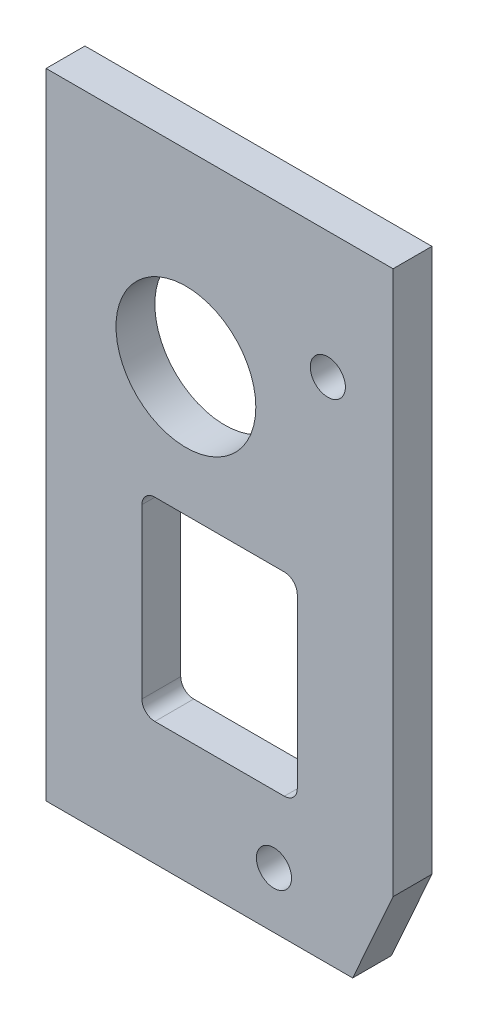
ISO-10303-21;
HEADER;
FILE_DESCRIPTION(('STEP AP214'),'2;1');
FILE_NAME('part.step','',(''),(''),'','','');
FILE_SCHEMA(('AUTOMOTIVE_DESIGN { 1 0 10303 214 1 1 1 1 }'));
ENDSEC;
DATA;
#1=APPLICATION_CONTEXT('core data for automotive mechanical design processes');
#2=APPLICATION_PROTOCOL_DEFINITION('international standard','automotive_design',2000,#1);
#3=PRODUCT_CONTEXT('',#1,'mechanical');
#4=PRODUCT('Part','Part','',(#3));
#5=PRODUCT_RELATED_PRODUCT_CATEGORY('part','',(#4));
#6=PRODUCT_DEFINITION_FORMATION('','',#4);
#7=PRODUCT_DEFINITION_CONTEXT('part definition',#1,'design');
#8=PRODUCT_DEFINITION('design','',#6,#7);
#9=PRODUCT_DEFINITION_SHAPE('','',#8);
#10=(LENGTH_UNIT() NAMED_UNIT(*) SI_UNIT(.MILLI.,.METRE.));
#11=(NAMED_UNIT(*) PLANE_ANGLE_UNIT() SI_UNIT($,.RADIAN.));
#12=(NAMED_UNIT(*) SI_UNIT($,.STERADIAN.) SOLID_ANGLE_UNIT());
#13=UNCERTAINTY_MEASURE_WITH_UNIT(LENGTH_MEASURE(1.E-05),#10,'distance_accuracy_value','');
#14=(GEOMETRIC_REPRESENTATION_CONTEXT(3) GLOBAL_UNCERTAINTY_ASSIGNED_CONTEXT((#13)) GLOBAL_UNIT_ASSIGNED_CONTEXT((#10,
#11,#12)) REPRESENTATION_CONTEXT('',''));
#15=CARTESIAN_POINT('',(0.,0.,0.));
#16=DIRECTION('',(0.,0.,1.));
#17=DIRECTION('',(1.,0.,0.));
#18=AXIS2_PLACEMENT_3D('',#15,#16,#17);
#19=CARTESIAN_POINT('',(0.,0.,4.7625));
#20=DIRECTION('',(0.,0.,1.));
#21=DIRECTION('',(1.,0.,0.));
#22=AXIS2_PLACEMENT_3D('',#19,#20,#21);
#23=PLANE('',#22);
#24=CARTESIAN_POINT('',(36.1314999999998,-33.2740000000007,4.7625));
#25=DIRECTION('',(0.,0.,1.));
#26=DIRECTION('',(1.,0.,0.));
#27=AXIS2_PLACEMENT_3D('',#24,#25,#26);
#28=CIRCLE('',#27,2.15264999999999);
#29=CARTESIAN_POINT('',(38.2841499999998,-33.2740000000007,4.76250000000001));
#30=VERTEX_POINT('',#29);
#31=EDGE_CURVE('E315',#30,#30,#28,.T.);
#32=ORIENTED_EDGE('',*,*,#31,.F.);
#33=EDGE_LOOP('',(#32));
#34=FACE_BOUND('',#33,.T.);
#35=CARTESIAN_POINT('',(29.5274999999979,-88.7095000000007,4.76250000000356));
#36=DIRECTION('',(0.,0.,1.));
#37=DIRECTION('',(1.,0.,0.));
#38=AXIS2_PLACEMENT_3D('',#35,#36,#37);
#39=CIRCLE('',#38,2.15264999999999);
#40=CARTESIAN_POINT('',(31.6801499999979,-88.7095000000007,4.76250000000356));
#41=VERTEX_POINT('',#40);
#42=EDGE_CURVE('E317',#41,#41,#39,.T.);
#43=ORIENTED_EDGE('',*,*,#42,.F.);
#44=EDGE_LOOP('',(#43));
#45=FACE_BOUND('',#44,.T.);
#46=CARTESIAN_POINT('',(18.7325,-40.8940000000002,4.76250000000444));
#47=DIRECTION('',(0.,0.,1.));
#48=DIRECTION('',(1.,0.,0.));
#49=AXIS2_PLACEMENT_3D('',#46,#47,#48);
#50=CIRCLE('',#49,8.57249999999999);
#51=CARTESIAN_POINT('',(27.305,-40.8940000000002,4.76250000000448));
#52=VERTEX_POINT('',#51);
#53=EDGE_CURVE('E325',#52,#52,#50,.T.);
#54=ORIENTED_EDGE('',*,*,#53,.F.);
#55=EDGE_LOOP('',(#54));
#56=FACE_BOUND('',#55,.T.);
#57=DIRECTION('',(-1.,0.,0.));
#58=VECTOR('',#57,1.);
#59=CARTESIAN_POINT('',(44.1325,-17.780000000003,4.76250000000444));
#60=LINE('',#59,#58);
#61=CARTESIAN_POINT('',(44.1325,-17.780000000003,4.76250000000444));
#62=VERTEX_POINT('',#61);
#63=CARTESIAN_POINT('',(1.58749999999996,-17.780000000003,4.76250000000444));
#64=VERTEX_POINT('',#63);
#65=EDGE_CURVE('E148',#62,#64,#60,.T.);
#66=ORIENTED_EDGE('',*,*,#65,.T.);
#67=DIRECTION('',(0.,-1.,0.));
#68=VECTOR('',#67,1.);
#69=CARTESIAN_POINT('',(1.58749999999996,-17.780000000003,4.76250000000444));
#70=LINE('',#69,#68);
#71=CARTESIAN_POINT('',(1.58749999999802,-95.5674999999996,4.76249999999911));
#72=VERTEX_POINT('',#71);
#73=EDGE_CURVE('E137',#64,#72,#70,.T.);
#74=ORIENTED_EDGE('',*,*,#73,.T.);
#75=DIRECTION('',(1.,0.,0.));
#76=VECTOR('',#75,1.);
#77=CARTESIAN_POINT('',(1.58749999999802,-95.5674999999996,4.76249999999911));
#78=LINE('',#77,#76);
#79=CARTESIAN_POINT('',(39.179499999998,-95.5674999999996,4.76249999999911));
#80=VERTEX_POINT('',#79);
#81=EDGE_CURVE('E147',#72,#80,#78,.T.);
#82=ORIENTED_EDGE('',*,*,#81,.T.);
#83=DIRECTION('',(0.407106771094067,0.913380576172593,0.));
#84=VECTOR('',#83,1.);
#85=CARTESIAN_POINT('',(39.179499999998,-95.5674999999996,4.76249999999911));
#86=LINE('',#85,#84);
#87=CARTESIAN_POINT('',(44.132499999998,-84.4549999999997,4.7625));
#88=VERTEX_POINT('',#87);
#89=EDGE_CURVE('E234',#80,#88,#86,.T.);
#90=ORIENTED_EDGE('',*,*,#89,.T.);
#91=DIRECTION('',(0.,1.,0.));
#92=VECTOR('',#91,1.);
#93=CARTESIAN_POINT('',(44.132499999998,-84.4549999999997,4.7625));
#94=LINE('',#93,#92);
#95=EDGE_CURVE('E152',#88,#62,#94,.T.);
#96=ORIENTED_EDGE('',*,*,#95,.T.);
#97=EDGE_LOOP('',(#66,#74,#82,#90,#96));
#98=FACE_BOUND('',#97,.T.);
#99=DIRECTION('',(0.,1.,0.));
#100=VECTOR('',#99,1.);
#101=CARTESIAN_POINT('',(32.3849999999981,-80.4545000000014,4.76249999999911));
#102=LINE('',#101,#100);
#103=CARTESIAN_POINT('',(32.3849999999981,-78.8669999999998,4.7625));
#104=VERTEX_POINT('',#103);
#105=CARTESIAN_POINT('',(32.3849999999981,-58.2295000000006,4.76250000000267));
#106=VERTEX_POINT('',#105);
#107=EDGE_CURVE('E214',#104,#106,#102,.T.);
#108=ORIENTED_EDGE('',*,*,#107,.F.);
#109=CARTESIAN_POINT('',(30.797499999998,-78.8669999999998,4.7625));
#110=DIRECTION('',(0.,0.,1.));
#111=DIRECTION('',(1.,0.,0.));
#112=AXIS2_PLACEMENT_3D('',#109,#110,#111);
#113=CIRCLE('',#112,1.5875);
#114=CARTESIAN_POINT('',(30.797499999998,-80.4545000000014,4.76249999999911));
#115=VERTEX_POINT('',#114);
#116=EDGE_CURVE('E195',#104,#115,#113,.F.);
#117=ORIENTED_EDGE('',*,*,#116,.T.);
#118=DIRECTION('',(1.,0.,0.));
#119=VECTOR('',#118,1.);
#120=CARTESIAN_POINT('',(13.334999999998,-80.4545000000014,4.76249999999911));
#121=LINE('',#120,#119);
#122=CARTESIAN_POINT('',(14.922499999998,-80.4545000000014,4.76249999999911));
#123=VERTEX_POINT('',#122);
#124=EDGE_CURVE('E217',#123,#115,#121,.T.);
#125=ORIENTED_EDGE('',*,*,#124,.F.);
#126=CARTESIAN_POINT('',(14.922499999998,-78.8669999999998,4.7625));
#127=DIRECTION('',(0.,0.,1.));
#128=DIRECTION('',(1.,0.,0.));
#129=AXIS2_PLACEMENT_3D('',#126,#127,#128);
#130=CIRCLE('',#129,1.5875);
#131=CARTESIAN_POINT('',(13.334999999998,-78.8669999999998,4.7625));
#132=VERTEX_POINT('',#131);
#133=EDGE_CURVE('E191',#123,#132,#130,.F.);
#134=ORIENTED_EDGE('',*,*,#133,.T.);
#135=DIRECTION('',(0.,-1.,0.));
#136=VECTOR('',#135,1.);
#137=CARTESIAN_POINT('',(13.334999999998,-56.6420000000003,4.76249999999911));
#138=LINE('',#137,#136);
#139=CARTESIAN_POINT('',(13.334999999998,-58.2295000000006,4.76250000000267));
#140=VERTEX_POINT('',#139);
#141=EDGE_CURVE('E219',#140,#132,#138,.T.);
#142=ORIENTED_EDGE('',*,*,#141,.F.);
#143=CARTESIAN_POINT('',(14.922499999998,-58.2295000000006,4.76250000000267));
#144=DIRECTION('',(0.,0.,1.));
#145=DIRECTION('',(1.,0.,0.));
#146=AXIS2_PLACEMENT_3D('',#143,#144,#145);
#147=CIRCLE('',#146,1.5875);
#148=CARTESIAN_POINT('',(14.922499999998,-56.6420000000003,4.76249999999911));
#149=VERTEX_POINT('',#148);
#150=EDGE_CURVE('E187',#140,#149,#147,.F.);
#151=ORIENTED_EDGE('',*,*,#150,.T.);
#152=DIRECTION('',(-1.,0.,0.));
#153=VECTOR('',#152,1.);
#154=CARTESIAN_POINT('',(32.3849999999981,-56.6420000000003,4.76249999999911));
#155=LINE('',#154,#153);
#156=CARTESIAN_POINT('',(30.797499999998,-56.6420000000003,4.76249999999911));
#157=VERTEX_POINT('',#156);
#158=EDGE_CURVE('E216',#157,#149,#155,.T.);
#159=ORIENTED_EDGE('',*,*,#158,.F.);
#160=CARTESIAN_POINT('',(30.797499999998,-58.2295000000006,4.76250000000267));
#161=DIRECTION('',(0.,0.,1.));
#162=DIRECTION('',(1.,0.,0.));
#163=AXIS2_PLACEMENT_3D('',#160,#161,#162);
#164=CIRCLE('',#163,1.5875);
#165=EDGE_CURVE('E11',#157,#106,#164,.F.);
#166=ORIENTED_EDGE('',*,*,#165,.T.);
#167=EDGE_LOOP('',(#108,#117,#125,#134,#142,#151,#159,#166));
#168=FACE_BOUND('',#167,.T.);
#169=ADVANCED_FACE('F42',(#34,#45,#56,#98,#168),#23,.T.);
#170=CARTESIAN_POINT('',(0.,0.,0.));
#171=DIRECTION('',(0.,0.,1.));
#172=DIRECTION('',(1.,0.,0.));
#173=AXIS2_PLACEMENT_3D('',#170,#171,#172);
#174=PLANE('',#173);
#175=CARTESIAN_POINT('',(36.1314999999998,-33.2740000000005,0.));
#176=DIRECTION('',(0.,0.,1.));
#177=DIRECTION('',(1.,0.,0.));
#178=AXIS2_PLACEMENT_3D('',#175,#176,#177);
#179=CIRCLE('',#178,2.15264999999999);
#180=CARTESIAN_POINT('',(38.2841499999998,-33.2740000000005,0.));
#181=VERTEX_POINT('',#180);
#182=EDGE_CURVE('E313',#181,#181,#179,.T.);
#183=ORIENTED_EDGE('',*,*,#182,.T.);
#184=EDGE_LOOP('',(#183));
#185=FACE_BOUND('',#184,.T.);
#186=CARTESIAN_POINT('',(29.5274999999979,-88.7095000000002,2.66453525910038E-12));
#187=DIRECTION('',(0.,0.,1.));
#188=DIRECTION('',(1.,0.,0.));
#189=AXIS2_PLACEMENT_3D('',#186,#187,#188);
#190=CIRCLE('',#189,2.15265);
#191=CARTESIAN_POINT('',(31.6801499999979,-88.7095000000002,2.67348602077844E-12));
#192=VERTEX_POINT('',#191);
#193=EDGE_CURVE('E322',#192,#192,#190,.T.);
#194=ORIENTED_EDGE('',*,*,#193,.T.);
#195=EDGE_LOOP('',(#194));
#196=FACE_BOUND('',#195,.T.);
#197=CARTESIAN_POINT('',(18.732499999998,-40.8939999999998,1.77635683940025E-12));
#198=DIRECTION('',(0.,0.,1.));
#199=DIRECTION('',(1.,0.,0.));
#200=AXIS2_PLACEMENT_3D('',#197,#198,#199);
#201=CIRCLE('',#200,8.57249999999999);
#202=CARTESIAN_POINT('',(27.304999999998,-40.8939999999998,1.81200146555185E-12));
#203=VERTEX_POINT('',#202);
#204=EDGE_CURVE('E230',#203,#203,#201,.T.);
#205=ORIENTED_EDGE('',*,*,#204,.T.);
#206=EDGE_LOOP('',(#205));
#207=FACE_BOUND('',#206,.T.);
#208=DIRECTION('',(-1.,0.,0.));
#209=VECTOR('',#208,1.);
#210=CARTESIAN_POINT('',(44.1325,-17.7799999999999,0.));
#211=LINE('',#210,#209);
#212=CARTESIAN_POINT('',(44.1325,-17.7799999999999,0.));
#213=VERTEX_POINT('',#212);
#214=CARTESIAN_POINT('',(1.58749999999996,-17.7799999999999,0.));
#215=VERTEX_POINT('',#214);
#216=EDGE_CURVE('E160',#213,#215,#211,.T.);
#217=ORIENTED_EDGE('',*,*,#216,.F.);
#218=DIRECTION('',(0.,1.,0.));
#219=VECTOR('',#218,1.);
#220=CARTESIAN_POINT('',(44.132499999998,-84.4550000000002,0.));
#221=LINE('',#220,#219);
#222=CARTESIAN_POINT('',(44.132499999998,-84.4550000000002,0.));
#223=VERTEX_POINT('',#222);
#224=EDGE_CURVE('E156',#223,#213,#221,.T.);
#225=ORIENTED_EDGE('',*,*,#224,.F.);
#226=DIRECTION('',(0.407106771094067,0.913380576172593,0.));
#227=VECTOR('',#226,1.);
#228=CARTESIAN_POINT('',(39.179499999998,-95.5675000000005,4.44089209850063E-12));
#229=LINE('',#228,#227);
#230=CARTESIAN_POINT('',(39.179499999998,-95.5675000000005,4.44089209850063E-12));
#231=VERTEX_POINT('',#230);
#232=EDGE_CURVE('E243',#231,#223,#229,.T.);
#233=ORIENTED_EDGE('',*,*,#232,.F.);
#234=DIRECTION('',(1.,0.,0.));
#235=VECTOR('',#234,1.);
#236=CARTESIAN_POINT('',(1.58749999999802,-95.5675000000009,3.5527136788005E-12));
#237=LINE('',#236,#235);
#238=CARTESIAN_POINT('',(1.58749999999802,-95.5675000000009,3.5527136788005E-12));
#239=VERTEX_POINT('',#238);
#240=EDGE_CURVE('E241',#239,#231,#237,.T.);
#241=ORIENTED_EDGE('',*,*,#240,.F.);
#242=DIRECTION('',(0.,-1.,0.));
#243=VECTOR('',#242,1.);
#244=CARTESIAN_POINT('',(1.58749999999996,-17.7799999999999,0.));
#245=LINE('',#244,#243);
#246=EDGE_CURVE('E239',#215,#239,#245,.T.);
#247=ORIENTED_EDGE('',*,*,#246,.F.);
#248=EDGE_LOOP('',(#217,#225,#233,#241,#247));
#249=FACE_BOUND('',#248,.T.);
#250=DIRECTION('',(0.,-1.,0.));
#251=VECTOR('',#250,1.);
#252=CARTESIAN_POINT('',(13.334999999998,-56.6420000000001,0.));
#253=LINE('',#252,#251);
#254=CARTESIAN_POINT('',(13.334999999998,-58.229500000001,6.21724893790088E-12));
#255=VERTEX_POINT('',#254);
#256=CARTESIAN_POINT('',(13.334999999998,-78.8669999999998,3.5527136788005E-12));
#257=VERTEX_POINT('',#256);
#258=EDGE_CURVE('E211',#255,#257,#253,.T.);
#259=ORIENTED_EDGE('',*,*,#258,.T.);
#260=CARTESIAN_POINT('',(14.922499999998,-78.8669999999998,3.5527136788005E-12));
#261=DIRECTION('',(0.,0.,1.));
#262=DIRECTION('',(1.,0.,0.));
#263=AXIS2_PLACEMENT_3D('',#260,#261,#262);
#264=CIRCLE('',#263,1.5875);
#265=CARTESIAN_POINT('',(14.922499999998,-80.4545000000001,0.));
#266=VERTEX_POINT('',#265);
#267=EDGE_CURVE('E189',#257,#266,#264,.T.);
#268=ORIENTED_EDGE('',*,*,#267,.T.);
#269=DIRECTION('',(1.,0.,0.));
#270=VECTOR('',#269,1.);
#271=CARTESIAN_POINT('',(13.334999999998,-80.4545000000001,0.));
#272=LINE('',#271,#270);
#273=CARTESIAN_POINT('',(30.797499999998,-80.4545000000001,0.));
#274=VERTEX_POINT('',#273);
#275=EDGE_CURVE('E227',#266,#274,#272,.T.);
#276=ORIENTED_EDGE('',*,*,#275,.T.);
#277=CARTESIAN_POINT('',(30.797499999998,-78.8669999999998,3.5527136788005E-12));
#278=DIRECTION('',(0.,0.,1.));
#279=DIRECTION('',(1.,0.,0.));
#280=AXIS2_PLACEMENT_3D('',#277,#278,#279);
#281=CIRCLE('',#280,1.5875);
#282=CARTESIAN_POINT('',(32.3849999999981,-78.8669999999998,3.5527136788005E-12));
#283=VERTEX_POINT('',#282);
#284=EDGE_CURVE('E193',#274,#283,#281,.T.);
#285=ORIENTED_EDGE('',*,*,#284,.T.);
#286=DIRECTION('',(0.,1.,0.));
#287=VECTOR('',#286,1.);
#288=CARTESIAN_POINT('',(32.3849999999981,-80.4545000000001,0.));
#289=LINE('',#288,#287);
#290=CARTESIAN_POINT('',(32.3849999999981,-58.229500000001,6.21724893790088E-12));
#291=VERTEX_POINT('',#290);
#292=EDGE_CURVE('E203',#283,#291,#289,.T.);
#293=ORIENTED_EDGE('',*,*,#292,.T.);
#294=CARTESIAN_POINT('',(30.797499999998,-58.229500000001,6.21724893790088E-12));
#295=DIRECTION('',(0.,0.,1.));
#296=DIRECTION('',(1.,0.,0.));
#297=AXIS2_PLACEMENT_3D('',#294,#295,#296);
#298=CIRCLE('',#297,1.5875);
#299=CARTESIAN_POINT('',(30.797499999998,-56.6420000000001,0.));
#300=VERTEX_POINT('',#299);
#301=EDGE_CURVE('E50',#291,#300,#298,.T.);
#302=ORIENTED_EDGE('',*,*,#301,.T.);
#303=DIRECTION('',(-1.,0.,0.));
#304=VECTOR('',#303,1.);
#305=CARTESIAN_POINT('',(32.3849999999981,-56.6420000000001,0.));
#306=LINE('',#305,#304);
#307=CARTESIAN_POINT('',(14.922499999998,-56.6420000000001,0.));
#308=VERTEX_POINT('',#307);
#309=EDGE_CURVE('E202',#300,#308,#306,.T.);
#310=ORIENTED_EDGE('',*,*,#309,.T.);
#311=CARTESIAN_POINT('',(14.922499999998,-58.229500000001,6.21724893790088E-12));
#312=DIRECTION('',(0.,0.,1.));
#313=DIRECTION('',(1.,0.,0.));
#314=AXIS2_PLACEMENT_3D('',#311,#312,#313);
#315=CIRCLE('',#314,1.5875);
#316=EDGE_CURVE('E185',#308,#255,#315,.T.);
#317=ORIENTED_EDGE('',*,*,#316,.T.);
#318=EDGE_LOOP('',(#259,#268,#276,#285,#293,#302,#310,#317));
#319=FACE_BOUND('',#318,.T.);
#320=ADVANCED_FACE('F201',(#185,#196,#207,#249,#319),#174,.F.);
#321=CARTESIAN_POINT('',(44.1325,-17.780000000003,4.76250000000444));
#322=DIRECTION('',(0.,-1.,0.));
#323=DIRECTION('',(1.,0.,0.));
#324=AXIS2_PLACEMENT_3D('',#321,#322,#323);
#325=PLANE('',#324);
#326=ORIENTED_EDGE('',*,*,#216,.T.);
#327=DIRECTION('',(0.,0.,-1.));
#328=VECTOR('',#327,1.);
#329=CARTESIAN_POINT('',(1.58749999999996,-17.780000000003,4.76250000000444));
#330=LINE('',#329,#328);
#331=EDGE_CURVE('E141',#64,#215,#330,.T.);
#332=ORIENTED_EDGE('',*,*,#331,.F.);
#333=ORIENTED_EDGE('',*,*,#65,.F.);
#334=DIRECTION('',(0.,0.,-1.));
#335=VECTOR('',#334,1.);
#336=CARTESIAN_POINT('',(44.1325,-17.780000000003,4.76250000000444));
#337=LINE('',#336,#335);
#338=EDGE_CURVE('E237',#62,#213,#337,.T.);
#339=ORIENTED_EDGE('',*,*,#338,.T.);
#340=EDGE_LOOP('',(#326,#332,#333,#339));
#341=FACE_BOUND('',#340,.T.);
#342=ADVANCED_FACE('F158',(#341),#325,.F.);
#343=CARTESIAN_POINT('',(1.58749999999996,-17.780000000003,4.76250000000444));
#344=DIRECTION('',(1.,0.,0.));
#345=DIRECTION('',(0.,1.,0.));
#346=AXIS2_PLACEMENT_3D('',#343,#344,#345);
#347=PLANE('',#346);
#348=ORIENTED_EDGE('',*,*,#246,.T.);
#349=DIRECTION('',(0.,0.,-1.));
#350=VECTOR('',#349,1.);
#351=CARTESIAN_POINT('',(1.58749999999802,-95.5674999999996,4.76249999999911));
#352=LINE('',#351,#350);
#353=EDGE_CURVE('E144',#72,#239,#352,.T.);
#354=ORIENTED_EDGE('',*,*,#353,.F.);
#355=ORIENTED_EDGE('',*,*,#73,.F.);
#356=ORIENTED_EDGE('',*,*,#331,.T.);
#357=EDGE_LOOP('',(#348,#354,#355,#356));
#358=FACE_BOUND('',#357,.T.);
#359=ADVANCED_FACE('F139',(#358),#347,.F.);
#360=CARTESIAN_POINT('',(1.58749999999802,-95.5674999999996,4.76249999999911));
#361=DIRECTION('',(0.,1.,0.));
#362=DIRECTION('',(0.,0.,1.));
#363=AXIS2_PLACEMENT_3D('',#360,#361,#362);
#364=PLANE('',#363);
#365=ORIENTED_EDGE('',*,*,#240,.T.);
#366=DIRECTION('',(0.,0.,-1.));
#367=VECTOR('',#366,1.);
#368=CARTESIAN_POINT('',(39.179499999998,-95.5674999999996,4.76249999999911));
#369=LINE('',#368,#367);
#370=EDGE_CURVE('E165',#80,#231,#369,.T.);
#371=ORIENTED_EDGE('',*,*,#370,.F.);
#372=ORIENTED_EDGE('',*,*,#81,.F.);
#373=ORIENTED_EDGE('',*,*,#353,.T.);
#374=EDGE_LOOP('',(#365,#371,#372,#373));
#375=FACE_BOUND('',#374,.T.);
#376=ADVANCED_FACE('F271',(#375),#364,.F.);
#377=CARTESIAN_POINT('',(39.179499999998,-95.5674999999996,4.76249999999911));
#378=DIRECTION('',(-0.913380576172585,0.40710677109407,0.));
#379=DIRECTION('',(-0.407106771094067,-0.913380576172593,0.));
#380=AXIS2_PLACEMENT_3D('',#377,#378,#379);
#381=PLANE('',#380);
#382=ORIENTED_EDGE('',*,*,#232,.T.);
#383=DIRECTION('',(0.,0.,-1.));
#384=VECTOR('',#383,1.);
#385=CARTESIAN_POINT('',(44.132499999998,-84.4549999999997,4.7625));
#386=LINE('',#385,#384);
#387=EDGE_CURVE('E247',#88,#223,#386,.T.);
#388=ORIENTED_EDGE('',*,*,#387,.F.);
#389=ORIENTED_EDGE('',*,*,#89,.F.);
#390=ORIENTED_EDGE('',*,*,#370,.T.);
#391=EDGE_LOOP('',(#382,#388,#389,#390));
#392=FACE_BOUND('',#391,.T.);
#393=ADVANCED_FACE('F254',(#392),#381,.F.);
#394=CARTESIAN_POINT('',(44.132499999998,-84.4549999999997,4.7625));
#395=DIRECTION('',(-1.,0.,0.));
#396=DIRECTION('',(0.,0.,1.));
#397=AXIS2_PLACEMENT_3D('',#394,#395,#396);
#398=PLANE('',#397);
#399=ORIENTED_EDGE('',*,*,#224,.T.);
#400=ORIENTED_EDGE('',*,*,#338,.F.);
#401=ORIENTED_EDGE('',*,*,#95,.F.);
#402=ORIENTED_EDGE('',*,*,#387,.T.);
#403=EDGE_LOOP('',(#399,#400,#401,#402));
#404=FACE_BOUND('',#403,.T.);
#405=ADVANCED_FACE('F261',(#404),#398,.F.);
#406=CARTESIAN_POINT('',(13.334999999998,-80.4545000000014,4.76249999999911));
#407=DIRECTION('',(0.,1.,0.));
#408=DIRECTION('',(0.,0.,1.));
#409=AXIS2_PLACEMENT_3D('',#406,#407,#408);
#410=PLANE('',#409);
#411=ORIENTED_EDGE('',*,*,#275,.F.);
#412=DIRECTION('',(0.,0.,-1.));
#413=VECTOR('',#412,1.);
#414=CARTESIAN_POINT('',(14.922499999998,-80.4545000000014,4.76249999999911));
#415=LINE('',#414,#413);
#416=EDGE_CURVE('E179',#266,#123,#415,.F.);
#417=ORIENTED_EDGE('',*,*,#416,.T.);
#418=ORIENTED_EDGE('',*,*,#124,.T.);
#419=DIRECTION('',(0.,0.,-1.));
#420=VECTOR('',#419,1.);
#421=CARTESIAN_POINT('',(30.797499999998,-80.4545000000001,0.));
#422=LINE('',#421,#420);
#423=EDGE_CURVE('E176',#115,#274,#422,.T.);
#424=ORIENTED_EDGE('',*,*,#423,.T.);
#425=EDGE_LOOP('',(#411,#417,#418,#424));
#426=FACE_BOUND('',#425,.T.);
#427=ADVANCED_FACE('F263',(#426),#410,.T.);
#428=CARTESIAN_POINT('',(32.3849999999981,-80.4545000000014,4.76249999999911));
#429=DIRECTION('',(-1.,0.,0.));
#430=DIRECTION('',(0.,-1.,0.));
#431=AXIS2_PLACEMENT_3D('',#428,#429,#430);
#432=PLANE('',#431);
#433=ORIENTED_EDGE('',*,*,#292,.F.);
#434=DIRECTION('',(0.,0.,-1.));
#435=VECTOR('',#434,1.);
#436=CARTESIAN_POINT('',(32.3849999999981,-78.8669999999998,4.7625));
#437=LINE('',#436,#435);
#438=EDGE_CURVE('E62',#283,#104,#437,.F.);
#439=ORIENTED_EDGE('',*,*,#438,.T.);
#440=ORIENTED_EDGE('',*,*,#107,.T.);
#441=DIRECTION('',(0.,0.,-1.));
#442=VECTOR('',#441,1.);
#443=CARTESIAN_POINT('',(32.3849999999981,-58.229500000001,6.21724893790088E-12));
#444=LINE('',#443,#442);
#445=EDGE_CURVE('E181',#106,#291,#444,.T.);
#446=ORIENTED_EDGE('',*,*,#445,.T.);
#447=EDGE_LOOP('',(#433,#439,#440,#446));
#448=FACE_BOUND('',#447,.T.);
#449=ADVANCED_FACE('F213',(#448),#432,.T.);
#450=CARTESIAN_POINT('',(32.3849999999981,-56.6420000000003,4.76249999999911));
#451=DIRECTION('',(0.,-1.,0.));
#452=DIRECTION('',(1.,0.,0.));
#453=AXIS2_PLACEMENT_3D('',#450,#451,#452);
#454=PLANE('',#453);
#455=ORIENTED_EDGE('',*,*,#158,.T.);
#456=DIRECTION('',(0.,0.,-1.));
#457=VECTOR('',#456,1.);
#458=CARTESIAN_POINT('',(14.922499999998,-56.6420000000001,0.));
#459=LINE('',#458,#457);
#460=EDGE_CURVE('E163',#149,#308,#459,.T.);
#461=ORIENTED_EDGE('',*,*,#460,.T.);
#462=ORIENTED_EDGE('',*,*,#309,.F.);
#463=DIRECTION('',(0.,0.,-1.));
#464=VECTOR('',#463,1.);
#465=CARTESIAN_POINT('',(30.797499999998,-56.6420000000003,4.76249999999911));
#466=LINE('',#465,#464);
#467=EDGE_CURVE('E161',#300,#157,#466,.F.);
#468=ORIENTED_EDGE('',*,*,#467,.T.);
#469=EDGE_LOOP('',(#455,#461,#462,#468));
#470=FACE_BOUND('',#469,.T.);
#471=ADVANCED_FACE('F209',(#470),#454,.T.);
#472=CARTESIAN_POINT('',(13.334999999998,-56.6420000000003,4.76249999999911));
#473=DIRECTION('',(1.,0.,0.));
#474=DIRECTION('',(0.,1.,0.));
#475=AXIS2_PLACEMENT_3D('',#472,#473,#474);
#476=PLANE('',#475);
#477=ORIENTED_EDGE('',*,*,#258,.F.);
#478=DIRECTION('',(0.,0.,-1.));
#479=VECTOR('',#478,1.);
#480=CARTESIAN_POINT('',(13.334999999998,-58.2295000000006,4.76250000000267));
#481=LINE('',#480,#479);
#482=EDGE_CURVE('E174',#255,#140,#481,.F.);
#483=ORIENTED_EDGE('',*,*,#482,.T.);
#484=ORIENTED_EDGE('',*,*,#141,.T.);
#485=DIRECTION('',(0.,0.,-1.));
#486=VECTOR('',#485,1.);
#487=CARTESIAN_POINT('',(13.334999999998,-78.8669999999998,3.5527136788005E-12));
#488=LINE('',#487,#486);
#489=EDGE_CURVE('E171',#132,#257,#488,.T.);
#490=ORIENTED_EDGE('',*,*,#489,.T.);
#491=EDGE_LOOP('',(#477,#483,#484,#490));
#492=FACE_BOUND('',#491,.T.);
#493=ADVANCED_FACE('F288',(#492),#476,.T.);
#494=CARTESIAN_POINT('',(18.732499999998,-40.8939999999998,1.77635683940025E-12));
#495=DIRECTION('',(0.,0.,1.));
#496=DIRECTION('',(1.,0.,0.));
#497=AXIS2_PLACEMENT_3D('',#494,#495,#496);
#498=CYLINDRICAL_SURFACE('',#497,8.57249999999999);
#499=ORIENTED_EDGE('',*,*,#204,.F.);
#500=EDGE_LOOP('',(#499));
#501=FACE_BOUND('',#500,.T.);
#502=ORIENTED_EDGE('',*,*,#53,.T.);
#503=EDGE_LOOP('',(#502));
#504=FACE_BOUND('',#503,.T.);
#505=ADVANCED_FACE('F291',(#501,#504),#498,.F.);
#506=CARTESIAN_POINT('',(29.5274999999979,-88.7095000000007,4.76250000000356));
#507=DIRECTION('',(0.,0.,1.));
#508=DIRECTION('',(1.,0.,0.));
#509=AXIS2_PLACEMENT_3D('',#506,#507,#508);
#510=CYLINDRICAL_SURFACE('',#509,2.15264999999999);
#511=ORIENTED_EDGE('',*,*,#193,.F.);
#512=EDGE_LOOP('',(#511));
#513=FACE_BOUND('',#512,.T.);
#514=ORIENTED_EDGE('',*,*,#42,.T.);
#515=EDGE_LOOP('',(#514));
#516=FACE_BOUND('',#515,.T.);
#517=ADVANCED_FACE('F295',(#513,#516),#510,.F.);
#518=CARTESIAN_POINT('',(36.1314999999998,-33.2740000000007,4.7625));
#519=DIRECTION('',(0.,0.,1.));
#520=DIRECTION('',(1.,0.,0.));
#521=AXIS2_PLACEMENT_3D('',#518,#519,#520);
#522=CYLINDRICAL_SURFACE('',#521,2.15264999999999);
#523=ORIENTED_EDGE('',*,*,#182,.F.);
#524=EDGE_LOOP('',(#523));
#525=FACE_BOUND('',#524,.T.);
#526=ORIENTED_EDGE('',*,*,#31,.T.);
#527=EDGE_LOOP('',(#526));
#528=FACE_BOUND('',#527,.T.);
#529=ADVANCED_FACE('F299',(#525,#528),#522,.F.);
#530=CARTESIAN_POINT('',(14.922499999998,-58.2295000000006,4.76250000000267));
#531=DIRECTION('',(0.,0.,1.));
#532=DIRECTION('',(1.,0.,0.));
#533=AXIS2_PLACEMENT_3D('',#530,#531,#532);
#534=CYLINDRICAL_SURFACE('',#533,1.5875);
#535=ORIENTED_EDGE('',*,*,#150,.F.);
#536=ORIENTED_EDGE('',*,*,#482,.F.);
#537=ORIENTED_EDGE('',*,*,#316,.F.);
#538=ORIENTED_EDGE('',*,*,#460,.F.);
#539=EDGE_LOOP('',(#535,#536,#537,#538));
#540=FACE_BOUND('',#539,.T.);
#541=ADVANCED_FACE('F302',(#540),#534,.F.);
#542=CARTESIAN_POINT('',(14.922499999998,-78.8669999999998,4.7625));
#543=DIRECTION('',(0.,0.,1.));
#544=DIRECTION('',(1.,0.,0.));
#545=AXIS2_PLACEMENT_3D('',#542,#543,#544);
#546=CYLINDRICAL_SURFACE('',#545,1.5875);
#547=ORIENTED_EDGE('',*,*,#133,.F.);
#548=ORIENTED_EDGE('',*,*,#416,.F.);
#549=ORIENTED_EDGE('',*,*,#267,.F.);
#550=ORIENTED_EDGE('',*,*,#489,.F.);
#551=EDGE_LOOP('',(#547,#548,#549,#550));
#552=FACE_BOUND('',#551,.T.);
#553=ADVANCED_FACE('F307',(#552),#546,.F.);
#554=CARTESIAN_POINT('',(30.797499999998,-78.8669999999998,4.7625));
#555=DIRECTION('',(0.,0.,1.));
#556=DIRECTION('',(1.,0.,0.));
#557=AXIS2_PLACEMENT_3D('',#554,#555,#556);
#558=CYLINDRICAL_SURFACE('',#557,1.5875);
#559=ORIENTED_EDGE('',*,*,#116,.F.);
#560=ORIENTED_EDGE('',*,*,#438,.F.);
#561=ORIENTED_EDGE('',*,*,#284,.F.);
#562=ORIENTED_EDGE('',*,*,#423,.F.);
#563=EDGE_LOOP('',(#559,#560,#561,#562));
#564=FACE_BOUND('',#563,.T.);
#565=ADVANCED_FACE('F340',(#564),#558,.F.);
#566=CARTESIAN_POINT('',(30.797499999998,-58.2295000000006,4.76250000000267));
#567=DIRECTION('',(0.,0.,1.));
#568=DIRECTION('',(1.,0.,0.));
#569=AXIS2_PLACEMENT_3D('',#566,#567,#568);
#570=CYLINDRICAL_SURFACE('',#569,1.5875);
#571=ORIENTED_EDGE('',*,*,#165,.F.);
#572=ORIENTED_EDGE('',*,*,#467,.F.);
#573=ORIENTED_EDGE('',*,*,#301,.F.);
#574=ORIENTED_EDGE('',*,*,#445,.F.);
#575=EDGE_LOOP('',(#571,#572,#573,#574));
#576=FACE_BOUND('',#575,.T.);
#577=ADVANCED_FACE('F44',(#576),#570,.F.);
#578=CLOSED_SHELL('',(#169,#320,#342,#359,#376,#393,#405,#427,#449,#471,#493,#505,#517,#529,
#541,#553,#565,#577));
#579=MANIFOLD_SOLID_BREP('B2',#578);
#580=ADVANCED_BREP_SHAPE_REPRESENTATION('',(#18,#579),#14);
#581=SHAPE_DEFINITION_REPRESENTATION(#9,#580);
ENDSEC;
END-ISO-10303-21;
